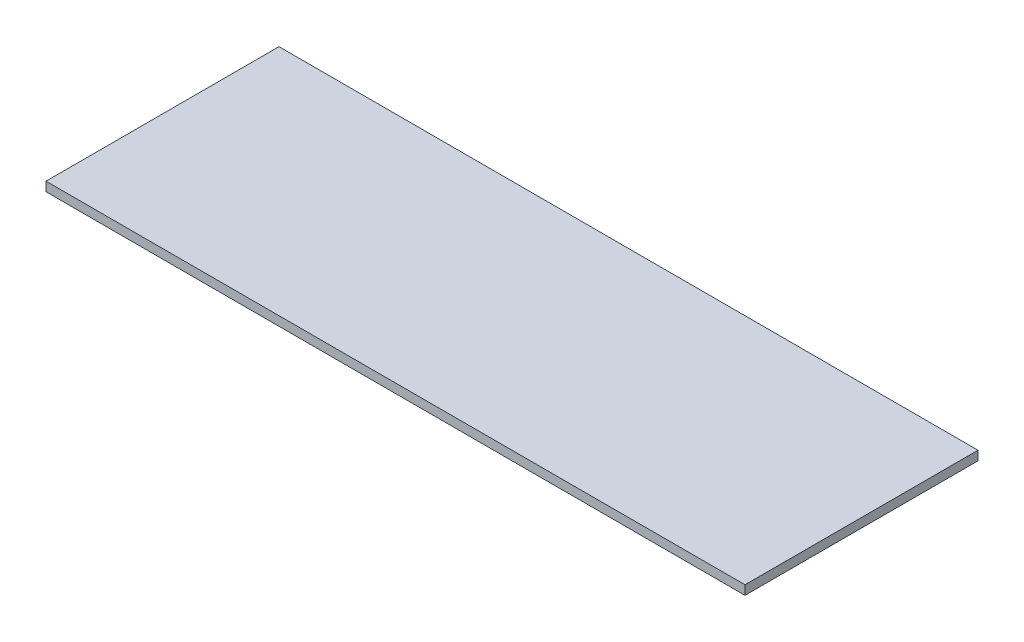
ISO-10303-21;
HEADER;
FILE_DESCRIPTION(('STEP AP214'),'2;1');
FILE_NAME('part.step','',(''),(''),'','','');
FILE_SCHEMA(('AUTOMOTIVE_DESIGN { 1 0 10303 214 1 1 1 1 }'));
ENDSEC;
DATA;
#1=APPLICATION_CONTEXT('core data for automotive mechanical design processes');
#2=APPLICATION_PROTOCOL_DEFINITION('international standard','automotive_design',2000,#1);
#3=PRODUCT_CONTEXT('',#1,'mechanical');
#4=PRODUCT('Part','Part','',(#3));
#5=PRODUCT_RELATED_PRODUCT_CATEGORY('part','',(#4));
#6=PRODUCT_DEFINITION_FORMATION('','',#4);
#7=PRODUCT_DEFINITION_CONTEXT('part definition',#1,'design');
#8=PRODUCT_DEFINITION('design','',#6,#7);
#9=PRODUCT_DEFINITION_SHAPE('','',#8);
#10=(LENGTH_UNIT() NAMED_UNIT(*) SI_UNIT(.MILLI.,.METRE.));
#11=(NAMED_UNIT(*) PLANE_ANGLE_UNIT() SI_UNIT($,.RADIAN.));
#12=(NAMED_UNIT(*) SI_UNIT($,.STERADIAN.) SOLID_ANGLE_UNIT());
#13=UNCERTAINTY_MEASURE_WITH_UNIT(LENGTH_MEASURE(1.E-05),#10,'distance_accuracy_value','');
#14=(GEOMETRIC_REPRESENTATION_CONTEXT(3) GLOBAL_UNCERTAINTY_ASSIGNED_CONTEXT((#13)) GLOBAL_UNIT_ASSIGNED_CONTEXT((#10,
#11,#12)) REPRESENTATION_CONTEXT('',''));
#15=CARTESIAN_POINT('',(0.,0.,0.));
#16=DIRECTION('',(0.,0.,1.));
#17=DIRECTION('',(1.,0.,0.));
#18=AXIS2_PLACEMENT_3D('',#15,#16,#17);
#19=CARTESIAN_POINT('',(38.1,1.,-12.7));
#20=DIRECTION('',(-1.,0.,0.));
#21=DIRECTION('',(0.,0.,1.));
#22=AXIS2_PLACEMENT_3D('',#19,#20,#21);
#23=PLANE('',#22);
#24=DIRECTION('',(0.,0.,-1.));
#25=VECTOR('',#24,1.);
#26=CARTESIAN_POINT('',(38.1,0.,-12.7));
#27=LINE('',#26,#25);
#28=CARTESIAN_POINT('',(38.1,0.,12.7));
#29=VERTEX_POINT('',#28);
#30=CARTESIAN_POINT('',(38.1,0.,-12.7));
#31=VERTEX_POINT('',#30);
#32=EDGE_CURVE('E98',#29,#31,#27,.T.);
#33=ORIENTED_EDGE('',*,*,#32,.T.);
#34=DIRECTION('',(0.,-1.,0.));
#35=VECTOR('',#34,1.);
#36=CARTESIAN_POINT('',(38.1,1.,-12.7));
#37=LINE('',#36,#35);
#38=CARTESIAN_POINT('',(38.1,1.,-12.7));
#39=VERTEX_POINT('',#38);
#40=EDGE_CURVE('E11',#39,#31,#37,.T.);
#41=ORIENTED_EDGE('',*,*,#40,.F.);
#42=DIRECTION('',(0.,0.,-1.));
#43=VECTOR('',#42,1.);
#44=CARTESIAN_POINT('',(38.1,1.,-12.7));
#45=LINE('',#44,#43);
#46=CARTESIAN_POINT('',(38.1,1.,12.7));
#47=VERTEX_POINT('',#46);
#48=EDGE_CURVE('E86',#47,#39,#45,.T.);
#49=ORIENTED_EDGE('',*,*,#48,.F.);
#50=DIRECTION('',(0.,-1.,0.));
#51=VECTOR('',#50,1.);
#52=CARTESIAN_POINT('',(38.1,1.,12.7));
#53=LINE('',#52,#51);
#54=EDGE_CURVE('E94',#47,#29,#53,.T.);
#55=ORIENTED_EDGE('',*,*,#54,.T.);
#56=EDGE_LOOP('',(#33,#41,#49,#55));
#57=FACE_BOUND('',#56,.T.);
#58=ADVANCED_FACE('F35',(#57),#23,.F.);
#59=CARTESIAN_POINT('',(-38.1,1.,-12.7));
#60=DIRECTION('',(0.,0.,1.));
#61=DIRECTION('',(1.,0.,0.));
#62=AXIS2_PLACEMENT_3D('',#59,#60,#61);
#63=PLANE('',#62);
#64=DIRECTION('',(-1.,0.,0.));
#65=VECTOR('',#64,1.);
#66=CARTESIAN_POINT('',(-38.1,0.,-12.7));
#67=LINE('',#66,#65);
#68=CARTESIAN_POINT('',(-38.1,0.,-12.7));
#69=VERTEX_POINT('',#68);
#70=EDGE_CURVE('E90',#31,#69,#67,.T.);
#71=ORIENTED_EDGE('',*,*,#70,.T.);
#72=DIRECTION('',(0.,-1.,0.));
#73=VECTOR('',#72,1.);
#74=CARTESIAN_POINT('',(-38.1,1.,-12.7));
#75=LINE('',#74,#73);
#76=CARTESIAN_POINT('',(-38.1,1.,-12.7));
#77=VERTEX_POINT('',#76);
#78=EDGE_CURVE('E43',#77,#69,#75,.T.);
#79=ORIENTED_EDGE('',*,*,#78,.F.);
#80=DIRECTION('',(-1.,0.,0.));
#81=VECTOR('',#80,1.);
#82=CARTESIAN_POINT('',(-38.1,1.,-12.7));
#83=LINE('',#82,#81);
#84=EDGE_CURVE('E81',#39,#77,#83,.T.);
#85=ORIENTED_EDGE('',*,*,#84,.F.);
#86=ORIENTED_EDGE('',*,*,#40,.T.);
#87=EDGE_LOOP('',(#71,#79,#85,#86));
#88=FACE_BOUND('',#87,.T.);
#89=ADVANCED_FACE('F89',(#88),#63,.F.);
#90=CARTESIAN_POINT('',(-38.1,1.,-12.7));
#91=DIRECTION('',(1.,0.,0.));
#92=DIRECTION('',(0.,0.,-1.));
#93=AXIS2_PLACEMENT_3D('',#90,#91,#92);
#94=PLANE('',#93);
#95=DIRECTION('',(0.,0.,1.));
#96=VECTOR('',#95,1.);
#97=CARTESIAN_POINT('',(-38.1,0.,-12.7));
#98=LINE('',#97,#96);
#99=CARTESIAN_POINT('',(-38.1,0.,12.7));
#100=VERTEX_POINT('',#99);
#101=EDGE_CURVE('E68',#69,#100,#98,.T.);
#102=ORIENTED_EDGE('',*,*,#101,.T.);
#103=DIRECTION('',(0.,-1.,0.));
#104=VECTOR('',#103,1.);
#105=CARTESIAN_POINT('',(-38.1,1.,12.7));
#106=LINE('',#105,#104);
#107=CARTESIAN_POINT('',(-38.1,1.,12.7));
#108=VERTEX_POINT('',#107);
#109=EDGE_CURVE('E91',#108,#100,#106,.T.);
#110=ORIENTED_EDGE('',*,*,#109,.F.);
#111=DIRECTION('',(0.,0.,1.));
#112=VECTOR('',#111,1.);
#113=CARTESIAN_POINT('',(-38.1,1.,-12.7));
#114=LINE('',#113,#112);
#115=EDGE_CURVE('E84',#77,#108,#114,.T.);
#116=ORIENTED_EDGE('',*,*,#115,.F.);
#117=ORIENTED_EDGE('',*,*,#78,.T.);
#118=EDGE_LOOP('',(#102,#110,#116,#117));
#119=FACE_BOUND('',#118,.T.);
#120=ADVANCED_FACE('F92',(#119),#94,.F.);
#121=CARTESIAN_POINT('',(-38.1,1.,12.7));
#122=DIRECTION('',(0.,0.,-1.));
#123=DIRECTION('',(-1.,0.,0.));
#124=AXIS2_PLACEMENT_3D('',#121,#122,#123);
#125=PLANE('',#124);
#126=DIRECTION('',(1.,0.,0.));
#127=VECTOR('',#126,1.);
#128=CARTESIAN_POINT('',(-38.1,0.,12.7));
#129=LINE('',#128,#127);
#130=EDGE_CURVE('E74',#100,#29,#129,.T.);
#131=ORIENTED_EDGE('',*,*,#130,.T.);
#132=ORIENTED_EDGE('',*,*,#54,.F.);
#133=DIRECTION('',(1.,0.,0.));
#134=VECTOR('',#133,1.);
#135=CARTESIAN_POINT('',(-38.1,1.,12.7));
#136=LINE('',#135,#134);
#137=EDGE_CURVE('E51',#108,#47,#136,.T.);
#138=ORIENTED_EDGE('',*,*,#137,.F.);
#139=ORIENTED_EDGE('',*,*,#109,.T.);
#140=EDGE_LOOP('',(#131,#132,#138,#139));
#141=FACE_BOUND('',#140,.T.);
#142=ADVANCED_FACE('F105',(#141),#125,.F.);
#143=CARTESIAN_POINT('',(0.,1.,0.));
#144=DIRECTION('',(0.,1.,0.));
#145=DIRECTION('',(0.,0.,1.));
#146=AXIS2_PLACEMENT_3D('',#143,#144,#145);
#147=PLANE('',#146);
#148=ORIENTED_EDGE('',*,*,#48,.T.);
#149=ORIENTED_EDGE('',*,*,#84,.T.);
#150=ORIENTED_EDGE('',*,*,#115,.T.);
#151=ORIENTED_EDGE('',*,*,#137,.T.);
#152=EDGE_LOOP('',(#148,#149,#150,#151));
#153=FACE_BOUND('',#152,.T.);
#154=ADVANCED_FACE('F82',(#153),#147,.T.);
#155=CARTESIAN_POINT('',(0.,0.,0.));
#156=DIRECTION('',(0.,1.,0.));
#157=DIRECTION('',(0.,0.,1.));
#158=AXIS2_PLACEMENT_3D('',#155,#156,#157);
#159=PLANE('',#158);
#160=ORIENTED_EDGE('',*,*,#32,.F.);
#161=ORIENTED_EDGE('',*,*,#130,.F.);
#162=ORIENTED_EDGE('',*,*,#101,.F.);
#163=ORIENTED_EDGE('',*,*,#70,.F.);
#164=EDGE_LOOP('',(#160,#161,#162,#163));
#165=FACE_BOUND('',#164,.T.);
#166=ADVANCED_FACE('F108',(#165),#159,.F.);
#167=CLOSED_SHELL('',(#58,#89,#120,#142,#154,#166));
#168=MANIFOLD_SOLID_BREP('B2',#167);
#169=ADVANCED_BREP_SHAPE_REPRESENTATION('',(#18,#168),#14);
#170=SHAPE_DEFINITION_REPRESENTATION(#9,#169);
ENDSEC;
END-ISO-10303-21;
